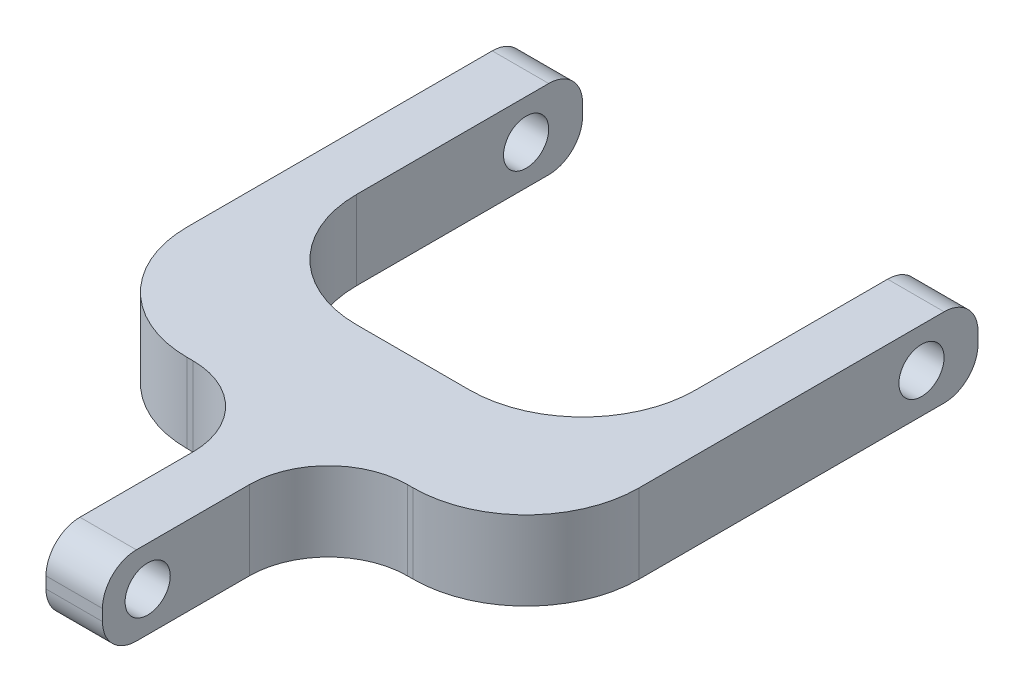
ISO-10303-21;
HEADER;
FILE_DESCRIPTION(('STEP AP214'),'2;1');
FILE_NAME('part.step','',(''),(''),'','','');
FILE_SCHEMA(('AUTOMOTIVE_DESIGN { 1 0 10303 214 1 1 1 1 }'));
ENDSEC;
DATA;
#1=APPLICATION_CONTEXT('core data for automotive mechanical design processes');
#2=APPLICATION_PROTOCOL_DEFINITION('international standard','automotive_design',2000,#1);
#3=PRODUCT_CONTEXT('',#1,'mechanical');
#4=PRODUCT('Part','Part','',(#3));
#5=PRODUCT_RELATED_PRODUCT_CATEGORY('part','',(#4));
#6=PRODUCT_DEFINITION_FORMATION('','',#4);
#7=PRODUCT_DEFINITION_CONTEXT('part definition',#1,'design');
#8=PRODUCT_DEFINITION('design','',#6,#7);
#9=PRODUCT_DEFINITION_SHAPE('','',#8);
#10=(LENGTH_UNIT() NAMED_UNIT(*) SI_UNIT(.MILLI.,.METRE.));
#11=(NAMED_UNIT(*) PLANE_ANGLE_UNIT() SI_UNIT($,.RADIAN.));
#12=(NAMED_UNIT(*) SI_UNIT($,.STERADIAN.) SOLID_ANGLE_UNIT());
#13=UNCERTAINTY_MEASURE_WITH_UNIT(LENGTH_MEASURE(1.E-05),#10,'distance_accuracy_value','');
#14=(GEOMETRIC_REPRESENTATION_CONTEXT(3) GLOBAL_UNCERTAINTY_ASSIGNED_CONTEXT((#13)) GLOBAL_UNIT_ASSIGNED_CONTEXT((#10,
#11,#12)) REPRESENTATION_CONTEXT('',''));
#15=CARTESIAN_POINT('',(0.,0.,0.));
#16=DIRECTION('',(0.,0.,1.));
#17=DIRECTION('',(1.,0.,0.));
#18=AXIS2_PLACEMENT_3D('',#15,#16,#17);
#19=CARTESIAN_POINT('',(40.,3.5,20.));
#20=DIRECTION('',(0.,0.,-1.));
#21=DIRECTION('',(-1.,0.,0.));
#22=AXIS2_PLACEMENT_3D('',#19,#20,#21);
#23=PLANE('',#22);
#24=DIRECTION('',(-1.,0.,0.));
#25=VECTOR('',#24,1.);
#26=CARTESIAN_POINT('',(40.,-3.5,20.));
#27=LINE('',#26,#25);
#28=CARTESIAN_POINT('',(10.5,-3.5,20.));
#29=VERTEX_POINT('',#28);
#30=CARTESIAN_POINT('',(10.,-3.5,20.));
#31=VERTEX_POINT('',#30);
#32=EDGE_CURVE('E292',#29,#31,#27,.T.);
#33=ORIENTED_EDGE('',*,*,#32,.F.);
#34=DIRECTION('',(0.,-1.,0.));
#35=VECTOR('',#34,1.);
#36=CARTESIAN_POINT('',(10.5,3.5,20.));
#37=LINE('',#36,#35);
#38=CARTESIAN_POINT('',(10.5,3.5,20.));
#39=VERTEX_POINT('',#38);
#40=EDGE_CURVE('E350',#29,#39,#37,.F.);
#41=ORIENTED_EDGE('',*,*,#40,.T.);
#42=DIRECTION('',(-1.,0.,0.));
#43=VECTOR('',#42,1.);
#44=CARTESIAN_POINT('',(40.,3.5,20.));
#45=LINE('',#44,#43);
#46=CARTESIAN_POINT('',(10.,3.5,20.));
#47=VERTEX_POINT('',#46);
#48=EDGE_CURVE('E305',#39,#47,#45,.T.);
#49=ORIENTED_EDGE('',*,*,#48,.T.);
#50=DIRECTION('',(0.,-1.,0.));
#51=VECTOR('',#50,1.);
#52=CARTESIAN_POINT('',(10.,3.5,20.));
#53=LINE('',#52,#51);
#54=EDGE_CURVE('E320',#47,#31,#53,.T.);
#55=ORIENTED_EDGE('',*,*,#54,.T.);
#56=EDGE_LOOP('',(#33,#41,#49,#55));
#57=FACE_BOUND('',#56,.T.);
#58=ADVANCED_FACE('F43',(#57),#23,.F.);
#59=CARTESIAN_POINT('',(30.,3.5,20.));
#60=VERTEX_POINT('',#59);
#61=CARTESIAN_POINT('',(29.5,3.5,20.));
#62=VERTEX_POINT('',#61);
#63=EDGE_CURVE('E306',#60,#62,#45,.T.);
#64=ORIENTED_EDGE('',*,*,#63,.T.);
#65=DIRECTION('',(0.,1.,0.));
#66=VECTOR('',#65,1.);
#67=CARTESIAN_POINT('',(29.5,-3.5,20.));
#68=LINE('',#67,#66);
#69=CARTESIAN_POINT('',(29.5,-3.5,20.));
#70=VERTEX_POINT('',#69);
#71=EDGE_CURVE('E343',#62,#70,#68,.F.);
#72=ORIENTED_EDGE('',*,*,#71,.T.);
#73=CARTESIAN_POINT('',(30.,-3.5,20.));
#74=VERTEX_POINT('',#73);
#75=EDGE_CURVE('E301',#74,#70,#27,.T.);
#76=ORIENTED_EDGE('',*,*,#75,.F.);
#77=DIRECTION('',(0.,-1.,0.));
#78=VECTOR('',#77,1.);
#79=CARTESIAN_POINT('',(30.,3.5,20.));
#80=LINE('',#79,#78);
#81=EDGE_CURVE('E324',#74,#60,#80,.F.);
#82=ORIENTED_EDGE('',*,*,#81,.T.);
#83=EDGE_LOOP('',(#64,#72,#76,#82));
#84=FACE_BOUND('',#83,.T.);
#85=ADVANCED_FACE('F477',(#84),#23,.F.);
#86=CARTESIAN_POINT('',(40.,3.5,-20.));
#87=DIRECTION('',(0.,0.,1.));
#88=DIRECTION('',(1.,0.,0.));
#89=AXIS2_PLACEMENT_3D('',#86,#87,#88);
#90=PLANE('',#89);
#91=DIRECTION('',(0.,1.,0.));
#92=VECTOR('',#91,1.);
#93=CARTESIAN_POINT('',(5.,-3.5,-20.));
#94=LINE('',#93,#92);
#95=CARTESIAN_POINT('',(5.,-0.5,-20.));
#96=VERTEX_POINT('',#95);
#97=CARTESIAN_POINT('',(5.,0.5,-20.));
#98=VERTEX_POINT('',#97);
#99=EDGE_CURVE('E266',#96,#98,#94,.T.);
#100=ORIENTED_EDGE('',*,*,#99,.F.);
#101=DIRECTION('',(-1.,0.,0.));
#102=VECTOR('',#101,1.);
#103=CARTESIAN_POINT('',(40.,-0.5,-20.));
#104=LINE('',#103,#102);
#105=CARTESIAN_POINT('',(0.,-0.5,-20.));
#106=VERTEX_POINT('',#105);
#107=EDGE_CURVE('E409',#96,#106,#104,.T.);
#108=ORIENTED_EDGE('',*,*,#107,.T.);
#109=DIRECTION('',(0.,1.,0.));
#110=VECTOR('',#109,1.);
#111=CARTESIAN_POINT('',(0.,3.5,-20.));
#112=LINE('',#111,#110);
#113=CARTESIAN_POINT('',(0.,0.5,-20.));
#114=VERTEX_POINT('',#113);
#115=EDGE_CURVE('E270',#106,#114,#112,.T.);
#116=ORIENTED_EDGE('',*,*,#115,.T.);
#117=DIRECTION('',(-1.,0.,0.));
#118=VECTOR('',#117,1.);
#119=CARTESIAN_POINT('',(40.,0.5,-20.));
#120=LINE('',#119,#118);
#121=EDGE_CURVE('E406',#114,#98,#120,.F.);
#122=ORIENTED_EDGE('',*,*,#121,.T.);
#123=EDGE_LOOP('',(#100,#108,#116,#122));
#124=FACE_BOUND('',#123,.T.);
#125=ADVANCED_FACE('F483',(#124),#90,.F.);
#126=DIRECTION('',(0.,1.,0.));
#127=VECTOR('',#126,1.);
#128=CARTESIAN_POINT('',(40.,3.5,-20.));
#129=LINE('',#128,#127);
#130=CARTESIAN_POINT('',(40.,-0.5,-20.));
#131=VERTEX_POINT('',#130);
#132=CARTESIAN_POINT('',(40.,0.5,-20.));
#133=VERTEX_POINT('',#132);
#134=EDGE_CURVE('E282',#131,#133,#129,.T.);
#135=ORIENTED_EDGE('',*,*,#134,.F.);
#136=DIRECTION('',(-1.,0.,0.));
#137=VECTOR('',#136,1.);
#138=CARTESIAN_POINT('',(40.,-0.5,-20.));
#139=LINE('',#138,#137);
#140=CARTESIAN_POINT('',(35.,-0.5,-20.));
#141=VERTEX_POINT('',#140);
#142=EDGE_CURVE('E427',#131,#141,#139,.T.);
#143=ORIENTED_EDGE('',*,*,#142,.T.);
#144=DIRECTION('',(0.,1.,0.));
#145=VECTOR('',#144,1.);
#146=CARTESIAN_POINT('',(35.,-3.5,-20.));
#147=LINE('',#146,#145);
#148=CARTESIAN_POINT('',(35.,0.5,-20.));
#149=VERTEX_POINT('',#148);
#150=EDGE_CURVE('E271',#141,#149,#147,.T.);
#151=ORIENTED_EDGE('',*,*,#150,.T.);
#152=DIRECTION('',(-1.,0.,0.));
#153=VECTOR('',#152,1.);
#154=CARTESIAN_POINT('',(40.,0.5,-20.));
#155=LINE('',#154,#153);
#156=EDGE_CURVE('E60',#149,#133,#155,.F.);
#157=ORIENTED_EDGE('',*,*,#156,.T.);
#158=EDGE_LOOP('',(#135,#143,#151,#157));
#159=FACE_BOUND('',#158,.T.);
#160=ADVANCED_FACE('F453',(#159),#90,.F.);
#161=CARTESIAN_POINT('',(40.,3.5,20.));
#162=DIRECTION('',(0.,-1.,0.));
#163=DIRECTION('',(0.,0.,-1.));
#164=AXIS2_PLACEMENT_3D('',#161,#162,#163);
#165=PLANE('',#164);
#166=DIRECTION('',(0.,0.,-1.));
#167=VECTOR('',#166,1.);
#168=CARTESIAN_POINT('',(17.5,3.5,40.));
#169=LINE('',#168,#167);
#170=CARTESIAN_POINT('',(17.5,3.5,37.));
#171=VERTEX_POINT('',#170);
#172=CARTESIAN_POINT('',(17.5,3.5,27.));
#173=VERTEX_POINT('',#172);
#174=EDGE_CURVE('E591',#171,#173,#169,.T.);
#175=ORIENTED_EDGE('',*,*,#174,.F.);
#176=DIRECTION('',(-1.,0.,0.));
#177=VECTOR('',#176,1.);
#178=CARTESIAN_POINT('',(22.5,3.5,37.));
#179=LINE('',#178,#177);
#180=CARTESIAN_POINT('',(22.5,3.5,37.));
#181=VERTEX_POINT('',#180);
#182=EDGE_CURVE('E403',#171,#181,#179,.F.);
#183=ORIENTED_EDGE('',*,*,#182,.T.);
#184=DIRECTION('',(0.,0.,-1.));
#185=VECTOR('',#184,1.);
#186=CARTESIAN_POINT('',(22.5,3.5,40.));
#187=LINE('',#186,#185);
#188=CARTESIAN_POINT('',(22.5,3.5,27.));
#189=VERTEX_POINT('',#188);
#190=EDGE_CURVE('E594',#181,#189,#187,.T.);
#191=ORIENTED_EDGE('',*,*,#190,.T.);
#192=CARTESIAN_POINT('',(29.5,3.5,27.));
#193=DIRECTION('',(0.,-1.,0.));
#194=DIRECTION('',(0.,0.,-1.));
#195=AXIS2_PLACEMENT_3D('',#192,#193,#194);
#196=CIRCLE('',#195,7.);
#197=EDGE_CURVE('E353',#189,#62,#196,.T.);
#198=ORIENTED_EDGE('',*,*,#197,.T.);
#199=ORIENTED_EDGE('',*,*,#63,.F.);
#200=CARTESIAN_POINT('',(30.,3.5,10.));
#201=DIRECTION('',(0.,-1.,0.));
#202=DIRECTION('',(0.,0.,-1.));
#203=AXIS2_PLACEMENT_3D('',#200,#201,#202);
#204=CIRCLE('',#203,10.);
#205=CARTESIAN_POINT('',(40.,3.5,10.));
#206=VERTEX_POINT('',#205);
#207=EDGE_CURVE('E331',#60,#206,#204,.F.);
#208=ORIENTED_EDGE('',*,*,#207,.T.);
#209=DIRECTION('',(0.,0.,1.));
#210=VECTOR('',#209,1.);
#211=CARTESIAN_POINT('',(40.,3.5,20.));
#212=LINE('',#211,#210);
#213=CARTESIAN_POINT('',(40.,3.5,-17.));
#214=VERTEX_POINT('',#213);
#215=EDGE_CURVE('E285',#214,#206,#212,.T.);
#216=ORIENTED_EDGE('',*,*,#215,.F.);
#217=DIRECTION('',(-1.,0.,0.));
#218=VECTOR('',#217,1.);
#219=CARTESIAN_POINT('',(40.,3.5,-17.));
#220=LINE('',#219,#218);
#221=CARTESIAN_POINT('',(35.,3.5,-17.));
#222=VERTEX_POINT('',#221);
#223=EDGE_CURVE('E395',#214,#222,#220,.T.);
#224=ORIENTED_EDGE('',*,*,#223,.T.);
#225=DIRECTION('',(0.,0.,-1.));
#226=VECTOR('',#225,1.);
#227=CARTESIAN_POINT('',(35.,3.5,-20.));
#228=LINE('',#227,#226);
#229=CARTESIAN_POINT('',(35.,3.5,0.));
#230=VERTEX_POINT('',#229);
#231=EDGE_CURVE('E219',#230,#222,#228,.T.);
#232=ORIENTED_EDGE('',*,*,#231,.F.);
#233=CARTESIAN_POINT('',(25.,3.5,0.));
#234=DIRECTION('',(0.,1.,0.));
#235=DIRECTION('',(0.,0.,1.));
#236=AXIS2_PLACEMENT_3D('',#233,#234,#235);
#237=CIRCLE('',#236,10.);
#238=CARTESIAN_POINT('',(25.,3.5,10.));
#239=VERTEX_POINT('',#238);
#240=EDGE_CURVE('E259',#239,#230,#237,.T.);
#241=ORIENTED_EDGE('',*,*,#240,.F.);
#242=DIRECTION('',(1.,0.,0.));
#243=VECTOR('',#242,1.);
#244=CARTESIAN_POINT('',(15.,3.5,10.));
#245=LINE('',#244,#243);
#246=CARTESIAN_POINT('',(15.,3.5,10.));
#247=VERTEX_POINT('',#246);
#248=EDGE_CURVE('E255',#247,#239,#245,.T.);
#249=ORIENTED_EDGE('',*,*,#248,.F.);
#250=CARTESIAN_POINT('',(15.,3.5,0.));
#251=DIRECTION('',(0.,1.,0.));
#252=DIRECTION('',(0.,0.,1.));
#253=AXIS2_PLACEMENT_3D('',#250,#251,#252);
#254=CIRCLE('',#253,10.);
#255=CARTESIAN_POINT('',(5.,3.5,0.));
#256=VERTEX_POINT('',#255);
#257=EDGE_CURVE('E251',#256,#247,#254,.T.);
#258=ORIENTED_EDGE('',*,*,#257,.F.);
#259=DIRECTION('',(0.,0.,1.));
#260=VECTOR('',#259,1.);
#261=CARTESIAN_POINT('',(5.,3.5,-20.));
#262=LINE('',#261,#260);
#263=CARTESIAN_POINT('',(5.,3.5,-17.));
#264=VERTEX_POINT('',#263);
#265=EDGE_CURVE('E225',#264,#256,#262,.T.);
#266=ORIENTED_EDGE('',*,*,#265,.F.);
#267=DIRECTION('',(-1.,0.,0.));
#268=VECTOR('',#267,1.);
#269=CARTESIAN_POINT('',(40.,3.5,-17.));
#270=LINE('',#269,#268);
#271=CARTESIAN_POINT('',(0.,3.5,-17.));
#272=VERTEX_POINT('',#271);
#273=EDGE_CURVE('E399',#264,#272,#270,.T.);
#274=ORIENTED_EDGE('',*,*,#273,.T.);
#275=DIRECTION('',(0.,0.,1.));
#276=VECTOR('',#275,1.);
#277=CARTESIAN_POINT('',(0.,3.5,20.));
#278=LINE('',#277,#276);
#279=CARTESIAN_POINT('',(0.,3.5,10.));
#280=VERTEX_POINT('',#279);
#281=EDGE_CURVE('E296',#272,#280,#278,.T.);
#282=ORIENTED_EDGE('',*,*,#281,.T.);
#283=CARTESIAN_POINT('',(10.,3.5,10.));
#284=DIRECTION('',(0.,-1.,0.));
#285=DIRECTION('',(0.,0.,-1.));
#286=AXIS2_PLACEMENT_3D('',#283,#284,#285);
#287=CIRCLE('',#286,10.);
#288=EDGE_CURVE('E327',#280,#47,#287,.F.);
#289=ORIENTED_EDGE('',*,*,#288,.T.);
#290=ORIENTED_EDGE('',*,*,#48,.F.);
#291=CARTESIAN_POINT('',(10.5,3.5,27.));
#292=DIRECTION('',(0.,-1.,0.));
#293=DIRECTION('',(0.,0.,-1.));
#294=AXIS2_PLACEMENT_3D('',#291,#292,#293);
#295=CIRCLE('',#294,7.);
#296=EDGE_CURVE('E363',#39,#173,#295,.T.);
#297=ORIENTED_EDGE('',*,*,#296,.T.);
#298=EDGE_LOOP('',(#175,#183,#191,#198,#199,#208,#216,#224,#232,#241,#249,#258,#266,#274,#282,
#289,#290,#297));
#299=FACE_BOUND('',#298,.T.);
#300=ADVANCED_FACE('F445',(#299),#165,.F.);
#301=CARTESIAN_POINT('',(40.,-3.5,20.));
#302=DIRECTION('',(0.,1.,0.));
#303=DIRECTION('',(0.,0.,1.));
#304=AXIS2_PLACEMENT_3D('',#301,#302,#303);
#305=PLANE('',#304);
#306=DIRECTION('',(0.,0.,-1.));
#307=VECTOR('',#306,1.);
#308=CARTESIAN_POINT('',(22.5,-3.5,40.));
#309=LINE('',#308,#307);
#310=CARTESIAN_POINT('',(22.5,-3.5,37.));
#311=VERTEX_POINT('',#310);
#312=CARTESIAN_POINT('',(22.5,-3.5,27.));
#313=VERTEX_POINT('',#312);
#314=EDGE_CURVE('E597',#311,#313,#309,.T.);
#315=ORIENTED_EDGE('',*,*,#314,.F.);
#316=DIRECTION('',(1.,0.,0.));
#317=VECTOR('',#316,1.);
#318=CARTESIAN_POINT('',(17.5,-3.5,37.));
#319=LINE('',#318,#317);
#320=CARTESIAN_POINT('',(17.5,-3.5,37.));
#321=VERTEX_POINT('',#320);
#322=EDGE_CURVE('E386',#311,#321,#319,.F.);
#323=ORIENTED_EDGE('',*,*,#322,.T.);
#324=DIRECTION('',(0.,0.,-1.));
#325=VECTOR('',#324,1.);
#326=CARTESIAN_POINT('',(17.5,-3.5,40.));
#327=LINE('',#326,#325);
#328=CARTESIAN_POINT('',(17.5,-3.5,27.));
#329=VERTEX_POINT('',#328);
#330=EDGE_CURVE('E252',#321,#329,#327,.T.);
#331=ORIENTED_EDGE('',*,*,#330,.T.);
#332=CARTESIAN_POINT('',(10.5,-3.5,27.));
#333=DIRECTION('',(0.,1.,0.));
#334=DIRECTION('',(0.,0.,1.));
#335=AXIS2_PLACEMENT_3D('',#332,#333,#334);
#336=CIRCLE('',#335,7.);
#337=EDGE_CURVE('E360',#329,#29,#336,.T.);
#338=ORIENTED_EDGE('',*,*,#337,.T.);
#339=ORIENTED_EDGE('',*,*,#32,.T.);
#340=CARTESIAN_POINT('',(10.,-3.5,10.));
#341=DIRECTION('',(0.,1.,0.));
#342=DIRECTION('',(0.,0.,1.));
#343=AXIS2_PLACEMENT_3D('',#340,#341,#342);
#344=CIRCLE('',#343,10.);
#345=CARTESIAN_POINT('',(0.,-3.5,10.));
#346=VERTEX_POINT('',#345);
#347=EDGE_CURVE('E314',#31,#346,#344,.F.);
#348=ORIENTED_EDGE('',*,*,#347,.T.);
#349=DIRECTION('',(0.,0.,-1.));
#350=VECTOR('',#349,1.);
#351=CARTESIAN_POINT('',(0.,-3.5,20.));
#352=LINE('',#351,#350);
#353=CARTESIAN_POINT('',(0.,-3.5,-17.));
#354=VERTEX_POINT('',#353);
#355=EDGE_CURVE('E286',#346,#354,#352,.T.);
#356=ORIENTED_EDGE('',*,*,#355,.T.);
#357=DIRECTION('',(-1.,0.,0.));
#358=VECTOR('',#357,1.);
#359=CARTESIAN_POINT('',(40.,-3.5,-17.));
#360=LINE('',#359,#358);
#361=CARTESIAN_POINT('',(5.,-3.5,-17.));
#362=VERTEX_POINT('',#361);
#363=EDGE_CURVE('E215',#354,#362,#360,.F.);
#364=ORIENTED_EDGE('',*,*,#363,.T.);
#365=DIRECTION('',(0.,0.,1.));
#366=VECTOR('',#365,1.);
#367=CARTESIAN_POINT('',(5.,-3.5,-20.));
#368=LINE('',#367,#366);
#369=CARTESIAN_POINT('',(5.,-3.5,0.));
#370=VERTEX_POINT('',#369);
#371=EDGE_CURVE('E206',#362,#370,#368,.T.);
#372=ORIENTED_EDGE('',*,*,#371,.T.);
#373=CARTESIAN_POINT('',(15.,-3.5,0.));
#374=DIRECTION('',(0.,1.,0.));
#375=DIRECTION('',(0.,0.,1.));
#376=AXIS2_PLACEMENT_3D('',#373,#374,#375);
#377=CIRCLE('',#376,10.);
#378=CARTESIAN_POINT('',(15.,-3.5,10.));
#379=VERTEX_POINT('',#378);
#380=EDGE_CURVE('E212',#370,#379,#377,.T.);
#381=ORIENTED_EDGE('',*,*,#380,.T.);
#382=DIRECTION('',(1.,0.,0.));
#383=VECTOR('',#382,1.);
#384=CARTESIAN_POINT('',(15.,-3.5,10.));
#385=LINE('',#384,#383);
#386=CARTESIAN_POINT('',(25.,-3.5,10.));
#387=VERTEX_POINT('',#386);
#388=EDGE_CURVE('E236',#379,#387,#385,.T.);
#389=ORIENTED_EDGE('',*,*,#388,.T.);
#390=CARTESIAN_POINT('',(25.,-3.5,0.));
#391=DIRECTION('',(0.,1.,0.));
#392=DIRECTION('',(0.,0.,1.));
#393=AXIS2_PLACEMENT_3D('',#390,#391,#392);
#394=CIRCLE('',#393,10.);
#395=CARTESIAN_POINT('',(35.,-3.5,0.));
#396=VERTEX_POINT('',#395);
#397=EDGE_CURVE('E239',#387,#396,#394,.T.);
#398=ORIENTED_EDGE('',*,*,#397,.T.);
#399=DIRECTION('',(0.,0.,-1.));
#400=VECTOR('',#399,1.);
#401=CARTESIAN_POINT('',(35.,-3.5,-20.));
#402=LINE('',#401,#400);
#403=CARTESIAN_POINT('',(35.,-3.5,-17.));
#404=VERTEX_POINT('',#403);
#405=EDGE_CURVE('E231',#396,#404,#402,.T.);
#406=ORIENTED_EDGE('',*,*,#405,.T.);
#407=DIRECTION('',(-1.,0.,0.));
#408=VECTOR('',#407,1.);
#409=CARTESIAN_POINT('',(40.,-3.5,-17.));
#410=LINE('',#409,#408);
#411=CARTESIAN_POINT('',(40.,-3.5,-17.));
#412=VERTEX_POINT('',#411);
#413=EDGE_CURVE('E381',#404,#412,#410,.F.);
#414=ORIENTED_EDGE('',*,*,#413,.T.);
#415=DIRECTION('',(0.,0.,-1.));
#416=VECTOR('',#415,1.);
#417=CARTESIAN_POINT('',(40.,-3.5,20.));
#418=LINE('',#417,#416);
#419=CARTESIAN_POINT('',(40.,-3.5,10.));
#420=VERTEX_POINT('',#419);
#421=EDGE_CURVE('E289',#420,#412,#418,.T.);
#422=ORIENTED_EDGE('',*,*,#421,.F.);
#423=CARTESIAN_POINT('',(30.,-3.5,10.));
#424=DIRECTION('',(0.,1.,0.));
#425=DIRECTION('',(0.,0.,1.));
#426=AXIS2_PLACEMENT_3D('',#423,#424,#425);
#427=CIRCLE('',#426,10.);
#428=EDGE_CURVE('E317',#420,#74,#427,.F.);
#429=ORIENTED_EDGE('',*,*,#428,.T.);
#430=ORIENTED_EDGE('',*,*,#75,.T.);
#431=CARTESIAN_POINT('',(29.5,-3.5,27.));
#432=DIRECTION('',(0.,1.,0.));
#433=DIRECTION('',(0.,0.,1.));
#434=AXIS2_PLACEMENT_3D('',#431,#432,#433);
#435=CIRCLE('',#434,7.);
#436=EDGE_CURVE('E356',#70,#313,#435,.T.);
#437=ORIENTED_EDGE('',*,*,#436,.T.);
#438=EDGE_LOOP('',(#315,#323,#331,#338,#339,#348,#356,#364,#372,#381,#389,#398,#406,#414,#422,
#429,#430,#437));
#439=FACE_BOUND('',#438,.T.);
#440=ADVANCED_FACE('F209',(#439),#305,.F.);
#441=CARTESIAN_POINT('',(40.,0.,0.));
#442=DIRECTION('',(1.,0.,0.));
#443=DIRECTION('',(0.,0.,-1.));
#444=AXIS2_PLACEMENT_3D('',#441,#442,#443);
#445=PLANE('',#444);
#446=CARTESIAN_POINT('',(40.,0.,-15.));
#447=DIRECTION('',(1.,0.,0.));
#448=DIRECTION('',(0.,0.,-1.));
#449=AXIS2_PLACEMENT_3D('',#446,#447,#448);
#450=CIRCLE('',#449,2.);
#451=CARTESIAN_POINT('',(40.,0.,-17.));
#452=VERTEX_POINT('',#451);
#453=EDGE_CURVE('E574',#452,#452,#450,.T.);
#454=ORIENTED_EDGE('',*,*,#453,.F.);
#455=EDGE_LOOP('',(#454));
#456=FACE_BOUND('',#455,.T.);
#457=ORIENTED_EDGE('',*,*,#421,.T.);
#458=CARTESIAN_POINT('',(40.,-0.5,-17.));
#459=DIRECTION('',(1.,0.,0.));
#460=DIRECTION('',(0.,0.,-1.));
#461=AXIS2_PLACEMENT_3D('',#458,#459,#460);
#462=CIRCLE('',#461,3.);
#463=EDGE_CURVE('E11',#412,#131,#462,.T.);
#464=ORIENTED_EDGE('',*,*,#463,.T.);
#465=ORIENTED_EDGE('',*,*,#134,.T.);
#466=CARTESIAN_POINT('',(40.,0.5,-17.));
#467=DIRECTION('',(1.,0.,0.));
#468=DIRECTION('',(0.,0.,-1.));
#469=AXIS2_PLACEMENT_3D('',#466,#467,#468);
#470=CIRCLE('',#469,3.);
#471=EDGE_CURVE('E53',#133,#214,#470,.T.);
#472=ORIENTED_EDGE('',*,*,#471,.T.);
#473=ORIENTED_EDGE('',*,*,#215,.T.);
#474=DIRECTION('',(0.,-1.,0.));
#475=VECTOR('',#474,1.);
#476=CARTESIAN_POINT('',(40.,-3.5,10.));
#477=LINE('',#476,#475);
#478=EDGE_CURVE('E310',#206,#420,#477,.T.);
#479=ORIENTED_EDGE('',*,*,#478,.T.);
#480=EDGE_LOOP('',(#457,#464,#465,#472,#473,#479));
#481=FACE_BOUND('',#480,.T.);
#482=ADVANCED_FACE('F440',(#456,#481),#445,.T.);
#483=CARTESIAN_POINT('',(0.,0.,0.));
#484=DIRECTION('',(1.,0.,0.));
#485=DIRECTION('',(0.,0.,-1.));
#486=AXIS2_PLACEMENT_3D('',#483,#484,#485);
#487=PLANE('',#486);
#488=CARTESIAN_POINT('',(0.,0.,-15.));
#489=DIRECTION('',(1.,0.,0.));
#490=DIRECTION('',(0.,0.,-1.));
#491=AXIS2_PLACEMENT_3D('',#488,#489,#490);
#492=CIRCLE('',#491,2.);
#493=CARTESIAN_POINT('',(0.,0.,-17.));
#494=VERTEX_POINT('',#493);
#495=EDGE_CURVE('E567',#494,#494,#492,.T.);
#496=ORIENTED_EDGE('',*,*,#495,.T.);
#497=EDGE_LOOP('',(#496));
#498=FACE_BOUND('',#497,.T.);
#499=ORIENTED_EDGE('',*,*,#115,.F.);
#500=CARTESIAN_POINT('',(0.,-0.5,-17.));
#501=DIRECTION('',(1.,0.,0.));
#502=DIRECTION('',(0.,0.,-1.));
#503=AXIS2_PLACEMENT_3D('',#500,#501,#502);
#504=CIRCLE('',#503,3.);
#505=EDGE_CURVE('E416',#106,#354,#504,.F.);
#506=ORIENTED_EDGE('',*,*,#505,.T.);
#507=ORIENTED_EDGE('',*,*,#355,.F.);
#508=DIRECTION('',(0.,-1.,0.));
#509=VECTOR('',#508,1.);
#510=CARTESIAN_POINT('',(0.,0.,10.));
#511=LINE('',#510,#509);
#512=EDGE_CURVE('E335',#346,#280,#511,.F.);
#513=ORIENTED_EDGE('',*,*,#512,.T.);
#514=ORIENTED_EDGE('',*,*,#281,.F.);
#515=CARTESIAN_POINT('',(0.,0.5,-17.));
#516=DIRECTION('',(1.,0.,0.));
#517=DIRECTION('',(0.,0.,-1.));
#518=AXIS2_PLACEMENT_3D('',#515,#516,#517);
#519=CIRCLE('',#518,3.);
#520=EDGE_CURVE('E413',#272,#114,#519,.F.);
#521=ORIENTED_EDGE('',*,*,#520,.T.);
#522=EDGE_LOOP('',(#499,#506,#507,#513,#514,#521));
#523=FACE_BOUND('',#522,.T.);
#524=ADVANCED_FACE('F560',(#498,#523),#487,.F.);
#525=CARTESIAN_POINT('',(5.,-3.5,-20.));
#526=DIRECTION('',(-1.,0.,0.));
#527=DIRECTION('',(0.,0.,1.));
#528=AXIS2_PLACEMENT_3D('',#525,#526,#527);
#529=PLANE('',#528);
#530=CARTESIAN_POINT('',(5.,0.,-15.));
#531=DIRECTION('',(-1.,0.,0.));
#532=DIRECTION('',(0.,0.,1.));
#533=AXIS2_PLACEMENT_3D('',#530,#531,#532);
#534=CIRCLE('',#533,2.);
#535=CARTESIAN_POINT('',(5.,0.,-13.));
#536=VERTEX_POINT('',#535);
#537=EDGE_CURVE('E566',#536,#536,#534,.T.);
#538=ORIENTED_EDGE('',*,*,#537,.T.);
#539=EDGE_LOOP('',(#538));
#540=FACE_BOUND('',#539,.T.);
#541=ORIENTED_EDGE('',*,*,#371,.F.);
#542=CARTESIAN_POINT('',(5.,-0.5,-17.));
#543=DIRECTION('',(-1.,0.,0.));
#544=DIRECTION('',(0.,0.,1.));
#545=AXIS2_PLACEMENT_3D('',#542,#543,#544);
#546=CIRCLE('',#545,3.);
#547=EDGE_CURVE('E422',#362,#96,#546,.F.);
#548=ORIENTED_EDGE('',*,*,#547,.T.);
#549=ORIENTED_EDGE('',*,*,#99,.T.);
#550=CARTESIAN_POINT('',(5.,0.5,-17.));
#551=DIRECTION('',(-1.,0.,0.));
#552=DIRECTION('',(0.,0.,1.));
#553=AXIS2_PLACEMENT_3D('',#550,#551,#552);
#554=CIRCLE('',#553,3.);
#555=EDGE_CURVE('E419',#98,#264,#554,.F.);
#556=ORIENTED_EDGE('',*,*,#555,.T.);
#557=ORIENTED_EDGE('',*,*,#265,.T.);
#558=DIRECTION('',(0.,1.,0.));
#559=VECTOR('',#558,1.);
#560=CARTESIAN_POINT('',(5.,-3.5,0.));
#561=LINE('',#560,#559);
#562=EDGE_CURVE('E222',#370,#256,#561,.T.);
#563=ORIENTED_EDGE('',*,*,#562,.F.);
#564=EDGE_LOOP('',(#541,#548,#549,#556,#557,#563));
#565=FACE_BOUND('',#564,.T.);
#566=ADVANCED_FACE('F223',(#540,#565),#529,.F.);
#567=CARTESIAN_POINT('',(35.,-3.5,-20.));
#568=DIRECTION('',(1.,0.,0.));
#569=DIRECTION('',(0.,0.,-1.));
#570=AXIS2_PLACEMENT_3D('',#567,#568,#569);
#571=PLANE('',#570);
#572=CARTESIAN_POINT('',(35.,0.,-15.));
#573=DIRECTION('',(1.,0.,0.));
#574=DIRECTION('',(0.,0.,-1.));
#575=AXIS2_PLACEMENT_3D('',#572,#573,#574);
#576=CIRCLE('',#575,2.);
#577=CARTESIAN_POINT('',(35.,0.,-17.));
#578=VERTEX_POINT('',#577);
#579=EDGE_CURVE('E47',#578,#578,#576,.T.);
#580=ORIENTED_EDGE('',*,*,#579,.T.);
#581=EDGE_LOOP('',(#580));
#582=FACE_BOUND('',#581,.T.);
#583=ORIENTED_EDGE('',*,*,#150,.F.);
#584=CARTESIAN_POINT('',(35.,-0.5,-17.));
#585=DIRECTION('',(1.,0.,0.));
#586=DIRECTION('',(0.,0.,-1.));
#587=AXIS2_PLACEMENT_3D('',#584,#585,#586);
#588=CIRCLE('',#587,3.);
#589=EDGE_CURVE('E434',#141,#404,#588,.F.);
#590=ORIENTED_EDGE('',*,*,#589,.T.);
#591=ORIENTED_EDGE('',*,*,#405,.F.);
#592=DIRECTION('',(0.,1.,0.));
#593=VECTOR('',#592,1.);
#594=CARTESIAN_POINT('',(35.,-3.5,0.));
#595=LINE('',#594,#593);
#596=EDGE_CURVE('E274',#396,#230,#595,.T.);
#597=ORIENTED_EDGE('',*,*,#596,.T.);
#598=ORIENTED_EDGE('',*,*,#231,.T.);
#599=CARTESIAN_POINT('',(35.,0.5,-17.));
#600=DIRECTION('',(1.,0.,0.));
#601=DIRECTION('',(0.,0.,-1.));
#602=AXIS2_PLACEMENT_3D('',#599,#600,#601);
#603=CIRCLE('',#602,3.);
#604=EDGE_CURVE('E431',#222,#149,#603,.F.);
#605=ORIENTED_EDGE('',*,*,#604,.T.);
#606=EDGE_LOOP('',(#583,#590,#591,#597,#598,#605));
#607=FACE_BOUND('',#606,.T.);
#608=ADVANCED_FACE('F452',(#582,#607),#571,.F.);
#609=CARTESIAN_POINT('',(25.,-3.5,0.));
#610=DIRECTION('',(0.,1.,0.));
#611=DIRECTION('',(0.,0.,1.));
#612=AXIS2_PLACEMENT_3D('',#609,#610,#611);
#613=CYLINDRICAL_SURFACE('',#612,10.);
#614=ORIENTED_EDGE('',*,*,#240,.T.);
#615=ORIENTED_EDGE('',*,*,#596,.F.);
#616=ORIENTED_EDGE('',*,*,#397,.F.);
#617=DIRECTION('',(0.,1.,0.));
#618=VECTOR('',#617,1.);
#619=CARTESIAN_POINT('',(25.,-3.5,10.));
#620=LINE('',#619,#618);
#621=EDGE_CURVE('E277',#387,#239,#620,.T.);
#622=ORIENTED_EDGE('',*,*,#621,.T.);
#623=EDGE_LOOP('',(#614,#615,#616,#622));
#624=FACE_BOUND('',#623,.T.);
#625=ADVANCED_FACE('F462',(#624),#613,.F.);
#626=CARTESIAN_POINT('',(15.,-3.5,10.));
#627=DIRECTION('',(0.,0.,1.));
#628=DIRECTION('',(1.,0.,0.));
#629=AXIS2_PLACEMENT_3D('',#626,#627,#628);
#630=PLANE('',#629);
#631=ORIENTED_EDGE('',*,*,#248,.T.);
#632=ORIENTED_EDGE('',*,*,#621,.F.);
#633=ORIENTED_EDGE('',*,*,#388,.F.);
#634=DIRECTION('',(0.,1.,0.));
#635=VECTOR('',#634,1.);
#636=CARTESIAN_POINT('',(15.,-3.5,10.));
#637=LINE('',#636,#635);
#638=EDGE_CURVE('E230',#379,#247,#637,.T.);
#639=ORIENTED_EDGE('',*,*,#638,.T.);
#640=EDGE_LOOP('',(#631,#632,#633,#639));
#641=FACE_BOUND('',#640,.T.);
#642=ADVANCED_FACE('F466',(#641),#630,.F.);
#643=CARTESIAN_POINT('',(15.,-3.5,0.));
#644=DIRECTION('',(0.,1.,0.));
#645=DIRECTION('',(0.,0.,1.));
#646=AXIS2_PLACEMENT_3D('',#643,#644,#645);
#647=CYLINDRICAL_SURFACE('',#646,10.);
#648=ORIENTED_EDGE('',*,*,#257,.T.);
#649=ORIENTED_EDGE('',*,*,#638,.F.);
#650=ORIENTED_EDGE('',*,*,#380,.F.);
#651=ORIENTED_EDGE('',*,*,#562,.T.);
#652=EDGE_LOOP('',(#648,#649,#650,#651));
#653=FACE_BOUND('',#652,.T.);
#654=ADVANCED_FACE('F234',(#653),#647,.F.);
#655=CARTESIAN_POINT('',(30.,0.,10.));
#656=DIRECTION('',(0.,1.,0.));
#657=DIRECTION('',(0.,0.,1.));
#658=AXIS2_PLACEMENT_3D('',#655,#656,#657);
#659=CYLINDRICAL_SURFACE('',#658,10.);
#660=ORIENTED_EDGE('',*,*,#207,.F.);
#661=ORIENTED_EDGE('',*,*,#81,.F.);
#662=ORIENTED_EDGE('',*,*,#428,.F.);
#663=ORIENTED_EDGE('',*,*,#478,.F.);
#664=EDGE_LOOP('',(#660,#661,#662,#663));
#665=FACE_BOUND('',#664,.T.);
#666=ADVANCED_FACE('F473',(#665),#659,.T.);
#667=CARTESIAN_POINT('',(10.,3.5,10.));
#668=DIRECTION('',(0.,-1.,0.));
#669=DIRECTION('',(0.,0.,-1.));
#670=AXIS2_PLACEMENT_3D('',#667,#668,#669);
#671=CYLINDRICAL_SURFACE('',#670,10.);
#672=ORIENTED_EDGE('',*,*,#288,.F.);
#673=ORIENTED_EDGE('',*,*,#512,.F.);
#674=ORIENTED_EDGE('',*,*,#347,.F.);
#675=ORIENTED_EDGE('',*,*,#54,.F.);
#676=EDGE_LOOP('',(#672,#673,#674,#675));
#677=FACE_BOUND('',#676,.T.);
#678=ADVANCED_FACE('F495',(#677),#671,.T.);
#679=CARTESIAN_POINT('',(17.5,3.5,40.));
#680=DIRECTION('',(1.,0.,0.));
#681=DIRECTION('',(0.,0.,-1.));
#682=AXIS2_PLACEMENT_3D('',#679,#680,#681);
#683=PLANE('',#682);
#684=CARTESIAN_POINT('',(17.5,0.,36.));
#685=DIRECTION('',(1.,0.,0.));
#686=DIRECTION('',(0.,0.,-1.));
#687=AXIS2_PLACEMENT_3D('',#684,#685,#686);
#688=CIRCLE('',#687,2.);
#689=CARTESIAN_POINT('',(17.5,0.,34.));
#690=VERTEX_POINT('',#689);
#691=EDGE_CURVE('E579',#690,#690,#688,.T.);
#692=ORIENTED_EDGE('',*,*,#691,.T.);
#693=EDGE_LOOP('',(#692));
#694=FACE_BOUND('',#693,.T.);
#695=ORIENTED_EDGE('',*,*,#330,.F.);
#696=CARTESIAN_POINT('',(17.5,-0.5,37.));
#697=DIRECTION('',(1.,0.,0.));
#698=DIRECTION('',(0.,0.,-1.));
#699=AXIS2_PLACEMENT_3D('',#696,#697,#698);
#700=CIRCLE('',#699,3.);
#701=CARTESIAN_POINT('',(17.5,-0.5,40.));
#702=VERTEX_POINT('',#701);
#703=EDGE_CURVE('E392',#321,#702,#700,.F.);
#704=ORIENTED_EDGE('',*,*,#703,.T.);
#705=DIRECTION('',(0.,-1.,0.));
#706=VECTOR('',#705,1.);
#707=CARTESIAN_POINT('',(17.5,3.5,40.));
#708=LINE('',#707,#706);
#709=CARTESIAN_POINT('',(17.5,0.5,40.));
#710=VERTEX_POINT('',#709);
#711=EDGE_CURVE('E571',#710,#702,#708,.T.);
#712=ORIENTED_EDGE('',*,*,#711,.F.);
#713=CARTESIAN_POINT('',(17.5,0.5,37.));
#714=DIRECTION('',(1.,0.,0.));
#715=DIRECTION('',(0.,0.,-1.));
#716=AXIS2_PLACEMENT_3D('',#713,#714,#715);
#717=CIRCLE('',#716,3.);
#718=EDGE_CURVE('E389',#710,#171,#717,.F.);
#719=ORIENTED_EDGE('',*,*,#718,.T.);
#720=ORIENTED_EDGE('',*,*,#174,.T.);
#721=DIRECTION('',(0.,-1.,0.));
#722=VECTOR('',#721,1.);
#723=CARTESIAN_POINT('',(17.5,-3.5,27.));
#724=LINE('',#723,#722);
#725=EDGE_CURVE('E346',#173,#329,#724,.T.);
#726=ORIENTED_EDGE('',*,*,#725,.T.);
#727=EDGE_LOOP('',(#695,#704,#712,#719,#720,#726));
#728=FACE_BOUND('',#727,.T.);
#729=ADVANCED_FACE('F499',(#694,#728),#683,.F.);
#730=CARTESIAN_POINT('',(22.5,3.5,40.));
#731=DIRECTION('',(-1.,0.,0.));
#732=DIRECTION('',(0.,0.,1.));
#733=AXIS2_PLACEMENT_3D('',#730,#731,#732);
#734=PLANE('',#733);
#735=CARTESIAN_POINT('',(22.5,0.,36.));
#736=DIRECTION('',(1.,0.,0.));
#737=DIRECTION('',(0.,0.,-1.));
#738=AXIS2_PLACEMENT_3D('',#735,#736,#737);
#739=CIRCLE('',#738,2.);
#740=CARTESIAN_POINT('',(22.5,0.,34.));
#741=VERTEX_POINT('',#740);
#742=EDGE_CURVE('E864',#741,#741,#739,.T.);
#743=ORIENTED_EDGE('',*,*,#742,.F.);
#744=EDGE_LOOP('',(#743));
#745=FACE_BOUND('',#744,.T.);
#746=DIRECTION('',(0.,1.,0.));
#747=VECTOR('',#746,1.);
#748=CARTESIAN_POINT('',(22.5,3.5,40.));
#749=LINE('',#748,#747);
#750=CARTESIAN_POINT('',(22.5,-0.5,40.));
#751=VERTEX_POINT('',#750);
#752=CARTESIAN_POINT('',(22.5,0.5,40.));
#753=VERTEX_POINT('',#752);
#754=EDGE_CURVE('E587',#751,#753,#749,.T.);
#755=ORIENTED_EDGE('',*,*,#754,.F.);
#756=CARTESIAN_POINT('',(22.5,-0.5,37.));
#757=DIRECTION('',(-1.,0.,0.));
#758=DIRECTION('',(0.,0.,1.));
#759=AXIS2_PLACEMENT_3D('',#756,#757,#758);
#760=CIRCLE('',#759,3.);
#761=EDGE_CURVE('E378',#751,#311,#760,.F.);
#762=ORIENTED_EDGE('',*,*,#761,.T.);
#763=ORIENTED_EDGE('',*,*,#314,.T.);
#764=DIRECTION('',(0.,1.,0.));
#765=VECTOR('',#764,1.);
#766=CARTESIAN_POINT('',(22.5,3.5,27.));
#767=LINE('',#766,#765);
#768=EDGE_CURVE('E339',#313,#189,#767,.T.);
#769=ORIENTED_EDGE('',*,*,#768,.T.);
#770=ORIENTED_EDGE('',*,*,#190,.F.);
#771=CARTESIAN_POINT('',(22.5,0.5,37.));
#772=DIRECTION('',(-1.,0.,0.));
#773=DIRECTION('',(0.,0.,1.));
#774=AXIS2_PLACEMENT_3D('',#771,#772,#773);
#775=CIRCLE('',#774,3.);
#776=EDGE_CURVE('E375',#181,#753,#775,.F.);
#777=ORIENTED_EDGE('',*,*,#776,.T.);
#778=EDGE_LOOP('',(#755,#762,#763,#769,#770,#777));
#779=FACE_BOUND('',#778,.T.);
#780=ADVANCED_FACE('F547',(#745,#779),#734,.F.);
#781=CARTESIAN_POINT('',(0.,0.,40.));
#782=DIRECTION('',(0.,0.,1.));
#783=DIRECTION('',(1.,0.,0.));
#784=AXIS2_PLACEMENT_3D('',#781,#782,#783);
#785=PLANE('',#784);
#786=ORIENTED_EDGE('',*,*,#711,.T.);
#787=DIRECTION('',(1.,0.,0.));
#788=VECTOR('',#787,1.);
#789=CARTESIAN_POINT('',(22.5,-0.5,40.));
#790=LINE('',#789,#788);
#791=EDGE_CURVE('E371',#702,#751,#790,.T.);
#792=ORIENTED_EDGE('',*,*,#791,.T.);
#793=ORIENTED_EDGE('',*,*,#754,.T.);
#794=DIRECTION('',(-1.,0.,0.));
#795=VECTOR('',#794,1.);
#796=CARTESIAN_POINT('',(17.5,0.5,40.));
#797=LINE('',#796,#795);
#798=EDGE_CURVE('E367',#753,#710,#797,.T.);
#799=ORIENTED_EDGE('',*,*,#798,.T.);
#800=EDGE_LOOP('',(#786,#792,#793,#799));
#801=FACE_BOUND('',#800,.T.);
#802=ADVANCED_FACE('F505',(#801),#785,.T.);
#803=CARTESIAN_POINT('',(29.5,3.5,27.));
#804=DIRECTION('',(0.,-1.,0.));
#805=DIRECTION('',(0.,0.,-1.));
#806=AXIS2_PLACEMENT_3D('',#803,#804,#805);
#807=CYLINDRICAL_SURFACE('',#806,7.);
#808=ORIENTED_EDGE('',*,*,#436,.F.);
#809=ORIENTED_EDGE('',*,*,#71,.F.);
#810=ORIENTED_EDGE('',*,*,#197,.F.);
#811=ORIENTED_EDGE('',*,*,#768,.F.);
#812=EDGE_LOOP('',(#808,#809,#810,#811));
#813=FACE_BOUND('',#812,.T.);
#814=ADVANCED_FACE('F501',(#813),#807,.F.);
#815=CARTESIAN_POINT('',(10.5,3.5,27.));
#816=DIRECTION('',(0.,1.,0.));
#817=DIRECTION('',(0.,0.,1.));
#818=AXIS2_PLACEMENT_3D('',#815,#816,#817);
#819=CYLINDRICAL_SURFACE('',#818,7.);
#820=ORIENTED_EDGE('',*,*,#296,.F.);
#821=ORIENTED_EDGE('',*,*,#40,.F.);
#822=ORIENTED_EDGE('',*,*,#337,.F.);
#823=ORIENTED_EDGE('',*,*,#725,.F.);
#824=EDGE_LOOP('',(#820,#821,#822,#823));
#825=FACE_BOUND('',#824,.T.);
#826=ADVANCED_FACE('F504',(#825),#819,.F.);
#827=CARTESIAN_POINT('',(0.,-0.5,37.));
#828=DIRECTION('',(-1.,0.,0.));
#829=DIRECTION('',(0.,0.,1.));
#830=AXIS2_PLACEMENT_3D('',#827,#828,#829);
#831=CYLINDRICAL_SURFACE('',#830,3.);
#832=ORIENTED_EDGE('',*,*,#703,.F.);
#833=ORIENTED_EDGE('',*,*,#322,.F.);
#834=ORIENTED_EDGE('',*,*,#761,.F.);
#835=ORIENTED_EDGE('',*,*,#791,.F.);
#836=EDGE_LOOP('',(#832,#833,#834,#835));
#837=FACE_BOUND('',#836,.T.);
#838=ADVANCED_FACE('F509',(#837),#831,.T.);
#839=CARTESIAN_POINT('',(0.,0.5,37.));
#840=DIRECTION('',(1.,0.,0.));
#841=DIRECTION('',(0.,0.,-1.));
#842=AXIS2_PLACEMENT_3D('',#839,#840,#841);
#843=CYLINDRICAL_SURFACE('',#842,3.);
#844=ORIENTED_EDGE('',*,*,#776,.F.);
#845=ORIENTED_EDGE('',*,*,#182,.F.);
#846=ORIENTED_EDGE('',*,*,#718,.F.);
#847=ORIENTED_EDGE('',*,*,#798,.F.);
#848=EDGE_LOOP('',(#844,#845,#846,#847));
#849=FACE_BOUND('',#848,.T.);
#850=ADVANCED_FACE('F513',(#849),#843,.T.);
#851=CARTESIAN_POINT('',(40.,-0.5,-17.));
#852=DIRECTION('',(-1.,0.,0.));
#853=DIRECTION('',(0.,0.,1.));
#854=AXIS2_PLACEMENT_3D('',#851,#852,#853);
#855=CYLINDRICAL_SURFACE('',#854,3.);
#856=ORIENTED_EDGE('',*,*,#547,.F.);
#857=ORIENTED_EDGE('',*,*,#363,.F.);
#858=ORIENTED_EDGE('',*,*,#505,.F.);
#859=ORIENTED_EDGE('',*,*,#107,.F.);
#860=EDGE_LOOP('',(#856,#857,#858,#859));
#861=FACE_BOUND('',#860,.T.);
#862=ADVANCED_FACE('F517',(#861),#855,.T.);
#863=CARTESIAN_POINT('',(40.,0.5,-17.));
#864=DIRECTION('',(-1.,0.,0.));
#865=DIRECTION('',(0.,0.,1.));
#866=AXIS2_PLACEMENT_3D('',#863,#864,#865);
#867=CYLINDRICAL_SURFACE('',#866,3.);
#868=ORIENTED_EDGE('',*,*,#555,.F.);
#869=ORIENTED_EDGE('',*,*,#121,.F.);
#870=ORIENTED_EDGE('',*,*,#520,.F.);
#871=ORIENTED_EDGE('',*,*,#273,.F.);
#872=EDGE_LOOP('',(#868,#869,#870,#871));
#873=FACE_BOUND('',#872,.T.);
#874=ADVANCED_FACE('F521',(#873),#867,.T.);
#875=CARTESIAN_POINT('',(40.,-0.5,-17.));
#876=DIRECTION('',(-1.,0.,0.));
#877=DIRECTION('',(0.,0.,1.));
#878=AXIS2_PLACEMENT_3D('',#875,#876,#877);
#879=CYLINDRICAL_SURFACE('',#878,3.);
#880=ORIENTED_EDGE('',*,*,#463,.F.);
#881=ORIENTED_EDGE('',*,*,#413,.F.);
#882=ORIENTED_EDGE('',*,*,#589,.F.);
#883=ORIENTED_EDGE('',*,*,#142,.F.);
#884=EDGE_LOOP('',(#880,#881,#882,#883));
#885=FACE_BOUND('',#884,.T.);
#886=ADVANCED_FACE('F456',(#885),#879,.T.);
#887=CARTESIAN_POINT('',(40.,0.5,-17.));
#888=DIRECTION('',(-1.,0.,0.));
#889=DIRECTION('',(0.,0.,1.));
#890=AXIS2_PLACEMENT_3D('',#887,#888,#889);
#891=CYLINDRICAL_SURFACE('',#890,3.);
#892=ORIENTED_EDGE('',*,*,#471,.F.);
#893=ORIENTED_EDGE('',*,*,#156,.F.);
#894=ORIENTED_EDGE('',*,*,#604,.F.);
#895=ORIENTED_EDGE('',*,*,#223,.F.);
#896=EDGE_LOOP('',(#892,#893,#894,#895));
#897=FACE_BOUND('',#896,.T.);
#898=ADVANCED_FACE('F45',(#897),#891,.T.);
#899=CARTESIAN_POINT('',(0.,0.,-15.));
#900=DIRECTION('',(1.,0.,0.));
#901=DIRECTION('',(0.,0.,-1.));
#902=AXIS2_PLACEMENT_3D('',#899,#900,#901);
#903=CYLINDRICAL_SURFACE('',#902,2.);
#904=ORIENTED_EDGE('',*,*,#453,.T.);
#905=EDGE_LOOP('',(#904));
#906=FACE_BOUND('',#905,.T.);
#907=ORIENTED_EDGE('',*,*,#579,.F.);
#908=EDGE_LOOP('',(#907));
#909=FACE_BOUND('',#908,.T.);
#910=ADVANCED_FACE('F529',(#906,#909),#903,.F.);
#911=ORIENTED_EDGE('',*,*,#495,.F.);
#912=EDGE_LOOP('',(#911));
#913=FACE_BOUND('',#912,.T.);
#914=ORIENTED_EDGE('',*,*,#537,.F.);
#915=EDGE_LOOP('',(#914));
#916=FACE_BOUND('',#915,.T.);
#917=ADVANCED_FACE('F533',(#913,#916),#903,.F.);
#918=CARTESIAN_POINT('',(0.,0.,36.));
#919=DIRECTION('',(1.,0.,0.));
#920=DIRECTION('',(0.,0.,-1.));
#921=AXIS2_PLACEMENT_3D('',#918,#919,#920);
#922=CYLINDRICAL_SURFACE('',#921,2.);
#923=ORIENTED_EDGE('',*,*,#742,.T.);
#924=EDGE_LOOP('',(#923));
#925=FACE_BOUND('',#924,.T.);
#926=ORIENTED_EDGE('',*,*,#691,.F.);
#927=EDGE_LOOP('',(#926));
#928=FACE_BOUND('',#927,.T.);
#929=ADVANCED_FACE('F539',(#925,#928),#922,.F.);
#930=CLOSED_SHELL('',(#58,#85,#125,#160,#300,#440,#482,#524,#566,#608,#625,#642,#654,#666,#678,
#729,#780,#802,#814,#826,#838,#850,#862,#874,#886,#898,#910,#917,#929));
#931=MANIFOLD_SOLID_BREP('B2',#930);
#932=ADVANCED_BREP_SHAPE_REPRESENTATION('',(#18,#931),#14);
#933=SHAPE_DEFINITION_REPRESENTATION(#9,#932);
ENDSEC;
END-ISO-10303-21;
